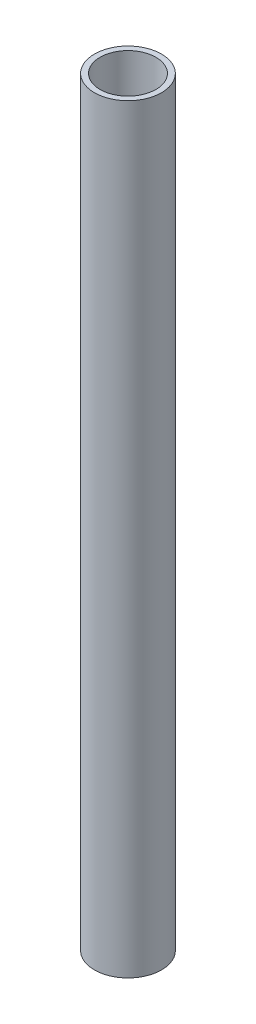
ISO-10303-21;
HEADER;
FILE_DESCRIPTION(('STEP AP214'),'2;1');
FILE_NAME('part.step','',(''),(''),'','','');
FILE_SCHEMA(('AUTOMOTIVE_DESIGN { 1 0 10303 214 1 1 1 1 }'));
ENDSEC;
DATA;
#1=APPLICATION_CONTEXT('core data for automotive mechanical design processes');
#2=APPLICATION_PROTOCOL_DEFINITION('international standard','automotive_design',2000,#1);
#3=PRODUCT_CONTEXT('',#1,'mechanical');
#4=PRODUCT('Part','Part','',(#3));
#5=PRODUCT_RELATED_PRODUCT_CATEGORY('part','',(#4));
#6=PRODUCT_DEFINITION_FORMATION('','',#4);
#7=PRODUCT_DEFINITION_CONTEXT('part definition',#1,'design');
#8=PRODUCT_DEFINITION('design','',#6,#7);
#9=PRODUCT_DEFINITION_SHAPE('','',#8);
#10=(LENGTH_UNIT() NAMED_UNIT(*) SI_UNIT(.MILLI.,.METRE.));
#11=(NAMED_UNIT(*) PLANE_ANGLE_UNIT() SI_UNIT($,.RADIAN.));
#12=(NAMED_UNIT(*) SI_UNIT($,.STERADIAN.) SOLID_ANGLE_UNIT());
#13=UNCERTAINTY_MEASURE_WITH_UNIT(LENGTH_MEASURE(1.E-05),#10,'distance_accuracy_value','');
#14=(GEOMETRIC_REPRESENTATION_CONTEXT(3) GLOBAL_UNCERTAINTY_ASSIGNED_CONTEXT((#13)) GLOBAL_UNIT_ASSIGNED_CONTEXT((#10,
#11,#12)) REPRESENTATION_CONTEXT('',''));
#15=CARTESIAN_POINT('',(0.,0.,0.));
#16=DIRECTION('',(0.,0.,1.));
#17=DIRECTION('',(1.,0.,0.));
#18=AXIS2_PLACEMENT_3D('',#15,#16,#17);
#19=CARTESIAN_POINT('',(0.,431.8,0.));
#20=DIRECTION('',(0.,1.,0.));
#21=DIRECTION('',(0.,0.,1.));
#22=AXIS2_PLACEMENT_3D('',#19,#20,#21);
#23=PLANE('',#22);
#24=CARTESIAN_POINT('',(0.,431.8,0.));
#25=DIRECTION('',(0.,1.,0.));
#26=DIRECTION('',(0.,0.,1.));
#27=AXIS2_PLACEMENT_3D('',#24,#25,#26);
#28=CIRCLE('',#27,19.05);
#29=CARTESIAN_POINT('',(0.,431.8,19.05));
#30=VERTEX_POINT('',#29);
#31=EDGE_CURVE('E10',#30,#30,#28,.T.);
#32=ORIENTED_EDGE('',*,*,#31,.T.);
#33=EDGE_LOOP('',(#32));
#34=FACE_BOUND('',#33,.T.);
#35=CARTESIAN_POINT('',(0.,431.8,0.));
#36=DIRECTION('',(0.,1.,0.));
#37=DIRECTION('',(0.,0.,1.));
#38=AXIS2_PLACEMENT_3D('',#35,#36,#37);
#39=CIRCLE('',#38,15.875);
#40=CARTESIAN_POINT('',(0.,431.8,15.875));
#41=VERTEX_POINT('',#40);
#42=EDGE_CURVE('E46',#41,#41,#39,.T.);
#43=ORIENTED_EDGE('',*,*,#42,.F.);
#44=EDGE_LOOP('',(#43));
#45=FACE_BOUND('',#44,.T.);
#46=ADVANCED_FACE('F35',(#34,#45),#23,.T.);
#47=CARTESIAN_POINT('',(0.,0.,0.));
#48=DIRECTION('',(0.,1.,0.));
#49=DIRECTION('',(0.,0.,1.));
#50=AXIS2_PLACEMENT_3D('',#47,#48,#49);
#51=PLANE('',#50);
#52=CARTESIAN_POINT('',(0.,0.,0.));
#53=DIRECTION('',(0.,1.,0.));
#54=DIRECTION('',(0.,0.,1.));
#55=AXIS2_PLACEMENT_3D('',#52,#53,#54);
#56=CIRCLE('',#55,19.05);
#57=CARTESIAN_POINT('',(0.,0.,19.05));
#58=VERTEX_POINT('',#57);
#59=EDGE_CURVE('E39',#58,#58,#56,.T.);
#60=ORIENTED_EDGE('',*,*,#59,.F.);
#61=EDGE_LOOP('',(#60));
#62=FACE_BOUND('',#61,.T.);
#63=CARTESIAN_POINT('',(0.,0.,0.));
#64=DIRECTION('',(0.,1.,0.));
#65=DIRECTION('',(0.,0.,1.));
#66=AXIS2_PLACEMENT_3D('',#63,#64,#65);
#67=CIRCLE('',#66,15.875);
#68=CARTESIAN_POINT('',(0.,0.,15.875));
#69=VERTEX_POINT('',#68);
#70=EDGE_CURVE('E48',#69,#69,#67,.T.);
#71=ORIENTED_EDGE('',*,*,#70,.T.);
#72=EDGE_LOOP('',(#71));
#73=FACE_BOUND('',#72,.T.);
#74=ADVANCED_FACE('F58',(#62,#73),#51,.F.);
#75=CARTESIAN_POINT('',(0.,431.8,0.));
#76=DIRECTION('',(0.,-1.,0.));
#77=DIRECTION('',(0.,0.,-1.));
#78=AXIS2_PLACEMENT_3D('',#75,#76,#77);
#79=CYLINDRICAL_SURFACE('',#78,19.05);
#80=ORIENTED_EDGE('',*,*,#31,.F.);
#81=EDGE_LOOP('',(#80));
#82=FACE_BOUND('',#81,.T.);
#83=ORIENTED_EDGE('',*,*,#59,.T.);
#84=EDGE_LOOP('',(#83));
#85=FACE_BOUND('',#84,.T.);
#86=ADVANCED_FACE('F37',(#82,#85),#79,.T.);
#87=CARTESIAN_POINT('',(0.,431.8,0.));
#88=DIRECTION('',(0.,-1.,0.));
#89=DIRECTION('',(0.,0.,-1.));
#90=AXIS2_PLACEMENT_3D('',#87,#88,#89);
#91=CYLINDRICAL_SURFACE('',#90,15.875);
#92=ORIENTED_EDGE('',*,*,#42,.T.);
#93=EDGE_LOOP('',(#92));
#94=FACE_BOUND('',#93,.T.);
#95=ORIENTED_EDGE('',*,*,#70,.F.);
#96=EDGE_LOOP('',(#95));
#97=FACE_BOUND('',#96,.T.);
#98=ADVANCED_FACE('F54',(#94,#97),#91,.F.);
#99=CLOSED_SHELL('',(#46,#74,#86,#98));
#100=MANIFOLD_SOLID_BREP('B2',#99);
#101=ADVANCED_BREP_SHAPE_REPRESENTATION('',(#18,#100),#14);
#102=SHAPE_DEFINITION_REPRESENTATION(#9,#101);
ENDSEC;
END-ISO-10303-21;
